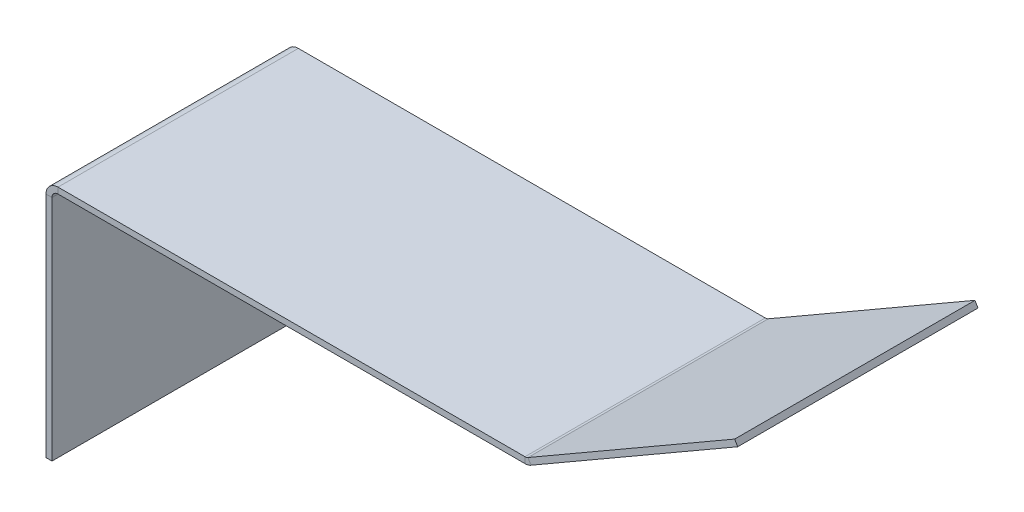
ISO-10303-21;
HEADER;
FILE_DESCRIPTION(('STEP AP214'),'2;1');
FILE_NAME('part.step','',(''),(''),'','','');
FILE_SCHEMA(('AUTOMOTIVE_DESIGN { 1 0 10303 214 1 1 1 1 }'));
ENDSEC;
DATA;
#1=APPLICATION_CONTEXT('core data for automotive mechanical design processes');
#2=APPLICATION_PROTOCOL_DEFINITION('international standard','automotive_design',2000,#1);
#3=PRODUCT_CONTEXT('',#1,'mechanical');
#4=PRODUCT('Part','Part','',(#3));
#5=PRODUCT_RELATED_PRODUCT_CATEGORY('part','',(#4));
#6=PRODUCT_DEFINITION_FORMATION('','',#4);
#7=PRODUCT_DEFINITION_CONTEXT('part definition',#1,'design');
#8=PRODUCT_DEFINITION('design','',#6,#7);
#9=PRODUCT_DEFINITION_SHAPE('','',#8);
#10=(LENGTH_UNIT() NAMED_UNIT(*) SI_UNIT(.MILLI.,.METRE.));
#11=(NAMED_UNIT(*) PLANE_ANGLE_UNIT() SI_UNIT($,.RADIAN.));
#12=(NAMED_UNIT(*) SI_UNIT($,.STERADIAN.) SOLID_ANGLE_UNIT());
#13=UNCERTAINTY_MEASURE_WITH_UNIT(LENGTH_MEASURE(1.E-05),#10,'distance_accuracy_value','');
#14=(GEOMETRIC_REPRESENTATION_CONTEXT(3) GLOBAL_UNCERTAINTY_ASSIGNED_CONTEXT((#13)) GLOBAL_UNIT_ASSIGNED_CONTEXT((#10,
#11,#12)) REPRESENTATION_CONTEXT('',''));
#15=CARTESIAN_POINT('',(0.,0.,0.));
#16=DIRECTION('',(0.,0.,1.));
#17=DIRECTION('',(1.,0.,0.));
#18=AXIS2_PLACEMENT_3D('',#15,#16,#17);
#19=CARTESIAN_POINT('',(6.35,127.,127.));
#20=DIRECTION('',(0.,0.,1.));
#21=DIRECTION('',(1.,0.,0.));
#22=AXIS2_PLACEMENT_3D('',#19,#20,#21);
#23=PLANE('',#22);
#24=DIRECTION('',(0.,-1.,0.));
#25=VECTOR('',#24,1.);
#26=CARTESIAN_POINT('',(6.35,127.,127.));
#27=LINE('',#26,#25);
#28=CARTESIAN_POINT('',(6.35,127.,127.));
#29=VERTEX_POINT('',#28);
#30=CARTESIAN_POINT('',(6.35,123.825,127.));
#31=VERTEX_POINT('',#30);
#32=EDGE_CURVE('E11',#29,#31,#27,.T.);
#33=ORIENTED_EDGE('',*,*,#32,.F.);
#34=CARTESIAN_POINT('',(6.35,120.65,127.));
#35=DIRECTION('',(0.,0.,1.));
#36=DIRECTION('',(1.,0.,0.));
#37=AXIS2_PLACEMENT_3D('',#34,#35,#36);
#38=CIRCLE('',#37,6.35);
#39=CARTESIAN_POINT('',(0.,120.65,127.));
#40=VERTEX_POINT('',#39);
#41=EDGE_CURVE('E290',#40,#29,#38,.F.);
#42=ORIENTED_EDGE('',*,*,#41,.F.);
#43=DIRECTION('',(-1.,0.,0.));
#44=VECTOR('',#43,1.);
#45=CARTESIAN_POINT('',(3.175,120.65,127.));
#46=LINE('',#45,#44);
#47=CARTESIAN_POINT('',(3.175,120.65,127.));
#48=VERTEX_POINT('',#47);
#49=EDGE_CURVE('E54',#48,#40,#46,.T.);
#50=ORIENTED_EDGE('',*,*,#49,.F.);
#51=CARTESIAN_POINT('',(6.35,120.65,127.));
#52=DIRECTION('',(0.,0.,1.));
#53=DIRECTION('',(1.,0.,0.));
#54=AXIS2_PLACEMENT_3D('',#51,#52,#53);
#55=CIRCLE('',#54,3.175);
#56=EDGE_CURVE('E155',#48,#31,#55,.F.);
#57=ORIENTED_EDGE('',*,*,#56,.T.);
#58=EDGE_LOOP('',(#33,#42,#50,#57));
#59=FACE_BOUND('',#58,.T.);
#60=ADVANCED_FACE('F45',(#59),#23,.T.);
#61=CARTESIAN_POINT('',(3.175,120.65,127.));
#62=DIRECTION('',(0.,0.,1.));
#63=DIRECTION('',(1.,0.,0.));
#64=AXIS2_PLACEMENT_3D('',#61,#62,#63);
#65=PLANE('',#64);
#66=DIRECTION('',(1.,0.,0.));
#67=VECTOR('',#66,1.);
#68=CARTESIAN_POINT('',(0.,127.,127.));
#69=LINE('',#68,#67);
#70=CARTESIAN_POINT('',(253.149261314031,127.,127.));
#71=VERTEX_POINT('',#70);
#72=EDGE_CURVE('E149',#29,#71,#69,.T.);
#73=ORIENTED_EDGE('',*,*,#72,.F.);
#74=ORIENTED_EDGE('',*,*,#32,.T.);
#75=DIRECTION('',(1.,0.,0.));
#76=VECTOR('',#75,1.);
#77=CARTESIAN_POINT('',(0.,123.825,127.));
#78=LINE('',#77,#76);
#79=CARTESIAN_POINT('',(253.149261314031,123.825,127.));
#80=VERTEX_POINT('',#79);
#81=EDGE_CURVE('E146',#31,#80,#78,.T.);
#82=ORIENTED_EDGE('',*,*,#81,.T.);
#83=DIRECTION('',(0.,1.,0.));
#84=VECTOR('',#83,1.);
#85=CARTESIAN_POINT('',(253.149261314031,123.825,127.));
#86=LINE('',#85,#84);
#87=EDGE_CURVE('E266',#80,#71,#86,.T.);
#88=ORIENTED_EDGE('',*,*,#87,.T.);
#89=EDGE_LOOP('',(#73,#74,#82,#88));
#90=FACE_BOUND('',#89,.T.);
#91=ADVANCED_FACE('F144',(#90),#65,.T.);
#92=CARTESIAN_POINT('',(0.,120.65,0.));
#93=DIRECTION('',(0.,0.,-1.));
#94=DIRECTION('',(-1.,0.,0.));
#95=AXIS2_PLACEMENT_3D('',#92,#93,#94);
#96=PLANE('',#95);
#97=DIRECTION('',(1.,0.,0.));
#98=VECTOR('',#97,1.);
#99=CARTESIAN_POINT('',(0.,120.65,0.));
#100=LINE('',#99,#98);
#101=CARTESIAN_POINT('',(0.,120.65,0.));
#102=VERTEX_POINT('',#101);
#103=CARTESIAN_POINT('',(3.175,120.65,0.));
#104=VERTEX_POINT('',#103);
#105=EDGE_CURVE('E274',#102,#104,#100,.T.);
#106=ORIENTED_EDGE('',*,*,#105,.F.);
#107=CARTESIAN_POINT('',(6.35,120.65,0.));
#108=DIRECTION('',(0.,0.,1.));
#109=DIRECTION('',(1.,0.,0.));
#110=AXIS2_PLACEMENT_3D('',#107,#108,#109);
#111=CIRCLE('',#110,6.35);
#112=CARTESIAN_POINT('',(6.35,127.,0.));
#113=VERTEX_POINT('',#112);
#114=EDGE_CURVE('E203',#102,#113,#111,.F.);
#115=ORIENTED_EDGE('',*,*,#114,.T.);
#116=DIRECTION('',(0.,1.,0.));
#117=VECTOR('',#116,1.);
#118=CARTESIAN_POINT('',(6.35,123.825,0.));
#119=LINE('',#118,#117);
#120=CARTESIAN_POINT('',(6.35,123.825,0.));
#121=VERTEX_POINT('',#120);
#122=EDGE_CURVE('E271',#121,#113,#119,.T.);
#123=ORIENTED_EDGE('',*,*,#122,.F.);
#124=CARTESIAN_POINT('',(6.35,120.65,0.));
#125=DIRECTION('',(0.,0.,1.));
#126=DIRECTION('',(1.,0.,0.));
#127=AXIS2_PLACEMENT_3D('',#124,#125,#126);
#128=CIRCLE('',#127,3.175);
#129=EDGE_CURVE('E168',#104,#121,#128,.F.);
#130=ORIENTED_EDGE('',*,*,#129,.F.);
#131=EDGE_LOOP('',(#106,#115,#123,#130));
#132=FACE_BOUND('',#131,.T.);
#133=ADVANCED_FACE('F337',(#132),#96,.T.);
#134=CARTESIAN_POINT('',(6.35,123.825,0.));
#135=DIRECTION('',(0.,0.,-1.));
#136=DIRECTION('',(-1.,0.,0.));
#137=AXIS2_PLACEMENT_3D('',#134,#135,#136);
#138=PLANE('',#137);
#139=DIRECTION('',(0.,1.,0.));
#140=VECTOR('',#139,1.);
#141=CARTESIAN_POINT('',(0.,0.,0.));
#142=LINE('',#141,#140);
#143=CARTESIAN_POINT('',(0.,0.,0.));
#144=VERTEX_POINT('',#143);
#145=EDGE_CURVE('E207',#144,#102,#142,.T.);
#146=ORIENTED_EDGE('',*,*,#145,.T.);
#147=ORIENTED_EDGE('',*,*,#105,.T.);
#148=DIRECTION('',(0.,1.,0.));
#149=VECTOR('',#148,1.);
#150=CARTESIAN_POINT('',(3.175,0.,0.));
#151=LINE('',#150,#149);
#152=CARTESIAN_POINT('',(3.175,0.,0.));
#153=VERTEX_POINT('',#152);
#154=EDGE_CURVE('E215',#153,#104,#151,.T.);
#155=ORIENTED_EDGE('',*,*,#154,.F.);
#156=DIRECTION('',(-1.,0.,0.));
#157=VECTOR('',#156,1.);
#158=CARTESIAN_POINT('',(3.175,0.,0.));
#159=LINE('',#158,#157);
#160=EDGE_CURVE('E211',#153,#144,#159,.T.);
#161=ORIENTED_EDGE('',*,*,#160,.T.);
#162=EDGE_LOOP('',(#146,#147,#155,#161));
#163=FACE_BOUND('',#162,.T.);
#164=ADVANCED_FACE('F340',(#163),#138,.T.);
#165=CARTESIAN_POINT('',(254.736761314031,127.425369342984,127.));
#166=DIRECTION('',(0.,0.,1.));
#167=DIRECTION('',(1.,0.,0.));
#168=AXIS2_PLACEMENT_3D('',#165,#166,#167);
#169=PLANE('',#168);
#170=DIRECTION('',(0.500000000000006,-0.866025403784435,0.));
#171=VECTOR('',#170,1.);
#172=CARTESIAN_POINT('',(254.736761314031,127.425369342984,127.));
#173=LINE('',#172,#171);
#174=CARTESIAN_POINT('',(254.736761314031,127.425369342984,127.));
#175=VERTEX_POINT('',#174);
#176=CARTESIAN_POINT('',(256.324261314031,124.675738685969,127.));
#177=VERTEX_POINT('',#176);
#178=EDGE_CURVE('E62',#175,#177,#173,.T.);
#179=ORIENTED_EDGE('',*,*,#178,.F.);
#180=CARTESIAN_POINT('',(253.149261314031,130.175,127.));
#181=DIRECTION('',(0.,0.,-1.));
#182=DIRECTION('',(-1.,0.,0.));
#183=AXIS2_PLACEMENT_3D('',#180,#181,#182);
#184=CIRCLE('',#183,3.175);
#185=EDGE_CURVE('E305',#71,#175,#184,.F.);
#186=ORIENTED_EDGE('',*,*,#185,.F.);
#187=ORIENTED_EDGE('',*,*,#87,.F.);
#188=CARTESIAN_POINT('',(253.149261314031,130.175,127.));
#189=DIRECTION('',(0.,0.,1.));
#190=DIRECTION('',(1.,0.,0.));
#191=AXIS2_PLACEMENT_3D('',#188,#189,#190);
#192=CIRCLE('',#191,6.35);
#193=EDGE_CURVE('E178',#80,#177,#192,.T.);
#194=ORIENTED_EDGE('',*,*,#193,.T.);
#195=EDGE_LOOP('',(#179,#186,#187,#194));
#196=FACE_BOUND('',#195,.T.);
#197=ADVANCED_FACE('F332',(#196),#169,.T.);
#198=CARTESIAN_POINT('',(253.149261314031,123.825,127.));
#199=DIRECTION('',(0.,0.,1.));
#200=DIRECTION('',(1.,0.,0.));
#201=AXIS2_PLACEMENT_3D('',#198,#199,#200);
#202=PLANE('',#201);
#203=DIRECTION('',(0.866025403784438,0.500000000000001,0.));
#204=VECTOR('',#203,1.);
#205=CARTESIAN_POINT('',(254.,127.,127.));
#206=LINE('',#205,#204);
#207=CARTESIAN_POINT('',(363.985226280624,190.5,127.));
#208=VERTEX_POINT('',#207);
#209=EDGE_CURVE('E309',#175,#208,#206,.T.);
#210=ORIENTED_EDGE('',*,*,#209,.F.);
#211=ORIENTED_EDGE('',*,*,#178,.T.);
#212=DIRECTION('',(0.866025403784438,0.500000000000002,0.));
#213=VECTOR('',#212,1.);
#214=CARTESIAN_POINT('',(255.5875,124.250369342984,127.));
#215=LINE('',#214,#213);
#216=CARTESIAN_POINT('',(365.572726280624,187.750369342985,127.));
#217=VERTEX_POINT('',#216);
#218=EDGE_CURVE('E116',#177,#217,#215,.T.);
#219=ORIENTED_EDGE('',*,*,#218,.T.);
#220=DIRECTION('',(0.500000000000023,-0.866025403784425,0.));
#221=VECTOR('',#220,1.);
#222=CARTESIAN_POINT('',(363.985226280624,190.5,127.));
#223=LINE('',#222,#221);
#224=EDGE_CURVE('E313',#208,#217,#223,.T.);
#225=ORIENTED_EDGE('',*,*,#224,.F.);
#226=EDGE_LOOP('',(#210,#211,#219,#225));
#227=FACE_BOUND('',#226,.T.);
#228=ADVANCED_FACE('F321',(#227),#202,.T.);
#229=CARTESIAN_POINT('',(253.149261314031,127.,0.));
#230=DIRECTION('',(0.,0.,-1.));
#231=DIRECTION('',(-1.,0.,0.));
#232=AXIS2_PLACEMENT_3D('',#229,#230,#231);
#233=PLANE('',#232);
#234=DIRECTION('',(0.,-1.,0.));
#235=VECTOR('',#234,1.);
#236=CARTESIAN_POINT('',(253.149261314031,127.,0.));
#237=LINE('',#236,#235);
#238=CARTESIAN_POINT('',(253.149261314031,127.,0.));
#239=VERTEX_POINT('',#238);
#240=CARTESIAN_POINT('',(253.149261314031,123.825,0.));
#241=VERTEX_POINT('',#240);
#242=EDGE_CURVE('E103',#239,#241,#237,.T.);
#243=ORIENTED_EDGE('',*,*,#242,.F.);
#244=CARTESIAN_POINT('',(253.149261314031,130.175,0.));
#245=DIRECTION('',(0.,0.,-1.));
#246=DIRECTION('',(-1.,0.,0.));
#247=AXIS2_PLACEMENT_3D('',#244,#245,#246);
#248=CIRCLE('',#247,3.175);
#249=CARTESIAN_POINT('',(254.736761314031,127.425369342984,0.));
#250=VERTEX_POINT('',#249);
#251=EDGE_CURVE('E197',#239,#250,#248,.F.);
#252=ORIENTED_EDGE('',*,*,#251,.T.);
#253=DIRECTION('',(-0.500000000000006,0.866025403784435,0.));
#254=VECTOR('',#253,1.);
#255=CARTESIAN_POINT('',(256.324261314031,124.675738685969,0.));
#256=LINE('',#255,#254);
#257=CARTESIAN_POINT('',(256.324261314031,124.675738685969,0.));
#258=VERTEX_POINT('',#257);
#259=EDGE_CURVE('E110',#258,#250,#256,.T.);
#260=ORIENTED_EDGE('',*,*,#259,.F.);
#261=CARTESIAN_POINT('',(253.149261314031,130.175,0.));
#262=DIRECTION('',(0.,0.,1.));
#263=DIRECTION('',(1.,0.,0.));
#264=AXIS2_PLACEMENT_3D('',#261,#262,#263);
#265=CIRCLE('',#264,6.35);
#266=EDGE_CURVE('E224',#241,#258,#265,.T.);
#267=ORIENTED_EDGE('',*,*,#266,.F.);
#268=EDGE_LOOP('',(#243,#252,#260,#267));
#269=FACE_BOUND('',#268,.T.);
#270=ADVANCED_FACE('F369',(#269),#233,.T.);
#271=CARTESIAN_POINT('',(256.324261314031,124.675738685969,0.));
#272=DIRECTION('',(0.,0.,-1.));
#273=DIRECTION('',(-1.,0.,0.));
#274=AXIS2_PLACEMENT_3D('',#271,#272,#273);
#275=PLANE('',#274);
#276=DIRECTION('',(1.,0.,0.));
#277=VECTOR('',#276,1.);
#278=CARTESIAN_POINT('',(0.,127.,0.));
#279=LINE('',#278,#277);
#280=EDGE_CURVE('E200',#113,#239,#279,.T.);
#281=ORIENTED_EDGE('',*,*,#280,.T.);
#282=ORIENTED_EDGE('',*,*,#242,.T.);
#283=DIRECTION('',(1.,0.,0.));
#284=VECTOR('',#283,1.);
#285=CARTESIAN_POINT('',(0.,123.825,0.));
#286=LINE('',#285,#284);
#287=EDGE_CURVE('E221',#121,#241,#286,.T.);
#288=ORIENTED_EDGE('',*,*,#287,.F.);
#289=ORIENTED_EDGE('',*,*,#122,.T.);
#290=EDGE_LOOP('',(#281,#282,#288,#289));
#291=FACE_BOUND('',#290,.T.);
#292=ADVANCED_FACE('F372',(#291),#275,.T.);
#293=CARTESIAN_POINT('',(255.5875,124.250369342984,127.));
#294=DIRECTION('',(-0.500000000000001,0.866025403784438,0.));
#295=DIRECTION('',(-0.866025403784438,-0.500000000000002,0.));
#296=AXIS2_PLACEMENT_3D('',#293,#294,#295);
#297=PLANE('',#296);
#298=DIRECTION('',(0.866025403784438,0.500000000000002,0.));
#299=VECTOR('',#298,1.);
#300=CARTESIAN_POINT('',(255.5875,124.250369342984,0.));
#301=LINE('',#300,#299);
#302=CARTESIAN_POINT('',(365.572726280624,187.750369342985,0.));
#303=VERTEX_POINT('',#302);
#304=EDGE_CURVE('E185',#258,#303,#301,.T.);
#305=ORIENTED_EDGE('',*,*,#304,.T.);
#306=DIRECTION('',(0.,0.,-1.));
#307=VECTOR('',#306,1.);
#308=CARTESIAN_POINT('',(365.572726280624,187.750369342985,127.));
#309=LINE('',#308,#307);
#310=EDGE_CURVE('E259',#217,#303,#309,.T.);
#311=ORIENTED_EDGE('',*,*,#310,.F.);
#312=ORIENTED_EDGE('',*,*,#218,.F.);
#313=DIRECTION('',(0.,0.,-1.));
#314=VECTOR('',#313,1.);
#315=CARTESIAN_POINT('',(256.324261314031,124.675738685969,127.));
#316=LINE('',#315,#314);
#317=EDGE_CURVE('E181',#177,#258,#316,.T.);
#318=ORIENTED_EDGE('',*,*,#317,.T.);
#319=EDGE_LOOP('',(#305,#311,#312,#318));
#320=FACE_BOUND('',#319,.T.);
#321=ADVANCED_FACE('F375',(#320),#297,.F.);
#322=CARTESIAN_POINT('',(363.985226280624,190.5,127.));
#323=DIRECTION('',(0.866025403784426,0.500000000000023,0.));
#324=DIRECTION('',(-0.500000000000023,0.866025403784426,0.));
#325=AXIS2_PLACEMENT_3D('',#322,#323,#324);
#326=PLANE('',#325);
#327=DIRECTION('',(0.500000000000023,-0.866025403784425,0.));
#328=VECTOR('',#327,1.);
#329=CARTESIAN_POINT('',(363.985226280624,190.5,0.));
#330=LINE('',#329,#328);
#331=CARTESIAN_POINT('',(363.985226280624,190.5,0.));
#332=VERTEX_POINT('',#331);
#333=EDGE_CURVE('E189',#332,#303,#330,.T.);
#334=ORIENTED_EDGE('',*,*,#333,.F.);
#335=DIRECTION('',(0.,0.,-1.));
#336=VECTOR('',#335,1.);
#337=CARTESIAN_POINT('',(363.985226280624,190.5,127.));
#338=LINE('',#337,#336);
#339=EDGE_CURVE('E256',#208,#332,#338,.T.);
#340=ORIENTED_EDGE('',*,*,#339,.F.);
#341=ORIENTED_EDGE('',*,*,#224,.T.);
#342=ORIENTED_EDGE('',*,*,#310,.T.);
#343=EDGE_LOOP('',(#334,#340,#341,#342));
#344=FACE_BOUND('',#343,.T.);
#345=ADVANCED_FACE('F320',(#344),#326,.T.);
#346=CARTESIAN_POINT('',(254.,127.,127.));
#347=DIRECTION('',(-0.500000000000001,0.866025403784438,0.));
#348=DIRECTION('',(-0.866025403784438,-0.500000000000001,0.));
#349=AXIS2_PLACEMENT_3D('',#346,#347,#348);
#350=PLANE('',#349);
#351=DIRECTION('',(0.866025403784438,0.500000000000001,0.));
#352=VECTOR('',#351,1.);
#353=CARTESIAN_POINT('',(254.,127.,0.));
#354=LINE('',#353,#352);
#355=EDGE_CURVE('E193',#250,#332,#354,.T.);
#356=ORIENTED_EDGE('',*,*,#355,.F.);
#357=DIRECTION('',(0.,0.,-1.));
#358=VECTOR('',#357,1.);
#359=CARTESIAN_POINT('',(254.736761314031,127.425369342984,127.));
#360=LINE('',#359,#358);
#361=EDGE_CURVE('E252',#175,#250,#360,.T.);
#362=ORIENTED_EDGE('',*,*,#361,.F.);
#363=ORIENTED_EDGE('',*,*,#209,.T.);
#364=ORIENTED_EDGE('',*,*,#339,.T.);
#365=EDGE_LOOP('',(#356,#362,#363,#364));
#366=FACE_BOUND('',#365,.T.);
#367=ADVANCED_FACE('F325',(#366),#350,.T.);
#368=CARTESIAN_POINT('',(253.149261314031,130.175,127.));
#369=DIRECTION('',(0.,0.,-1.));
#370=DIRECTION('',(-1.,0.,0.));
#371=AXIS2_PLACEMENT_3D('',#368,#369,#370);
#372=CYLINDRICAL_SURFACE('',#371,3.175);
#373=ORIENTED_EDGE('',*,*,#251,.F.);
#374=DIRECTION('',(0.,0.,-1.));
#375=VECTOR('',#374,1.);
#376=CARTESIAN_POINT('',(253.149261314031,127.,127.));
#377=LINE('',#376,#375);
#378=EDGE_CURVE('E248',#71,#239,#377,.T.);
#379=ORIENTED_EDGE('',*,*,#378,.F.);
#380=ORIENTED_EDGE('',*,*,#185,.T.);
#381=ORIENTED_EDGE('',*,*,#361,.T.);
#382=EDGE_LOOP('',(#373,#379,#380,#381));
#383=FACE_BOUND('',#382,.T.);
#384=ADVANCED_FACE('F328',(#383),#372,.F.);
#385=CARTESIAN_POINT('',(0.,127.,127.));
#386=DIRECTION('',(0.,1.,0.));
#387=DIRECTION('',(0.,0.,1.));
#388=AXIS2_PLACEMENT_3D('',#385,#386,#387);
#389=PLANE('',#388);
#390=ORIENTED_EDGE('',*,*,#280,.F.);
#391=DIRECTION('',(0.,0.,-1.));
#392=VECTOR('',#391,1.);
#393=CARTESIAN_POINT('',(6.35,127.,127.));
#394=LINE('',#393,#392);
#395=EDGE_CURVE('E244',#29,#113,#394,.T.);
#396=ORIENTED_EDGE('',*,*,#395,.F.);
#397=ORIENTED_EDGE('',*,*,#72,.T.);
#398=ORIENTED_EDGE('',*,*,#378,.T.);
#399=EDGE_LOOP('',(#390,#396,#397,#398));
#400=FACE_BOUND('',#399,.T.);
#401=ADVANCED_FACE('F335',(#400),#389,.T.);
#402=CARTESIAN_POINT('',(6.35,120.65,127.));
#403=DIRECTION('',(0.,0.,-1.));
#404=DIRECTION('',(-1.,0.,0.));
#405=AXIS2_PLACEMENT_3D('',#402,#403,#404);
#406=CYLINDRICAL_SURFACE('',#405,6.35);
#407=ORIENTED_EDGE('',*,*,#114,.F.);
#408=DIRECTION('',(0.,0.,-1.));
#409=VECTOR('',#408,1.);
#410=CARTESIAN_POINT('',(0.,120.65,127.));
#411=LINE('',#410,#409);
#412=EDGE_CURVE('E240',#40,#102,#411,.T.);
#413=ORIENTED_EDGE('',*,*,#412,.F.);
#414=ORIENTED_EDGE('',*,*,#41,.T.);
#415=ORIENTED_EDGE('',*,*,#395,.T.);
#416=EDGE_LOOP('',(#407,#413,#414,#415));
#417=FACE_BOUND('',#416,.T.);
#418=ADVANCED_FACE('F289',(#417),#406,.T.);
#419=CARTESIAN_POINT('',(0.,0.,127.));
#420=DIRECTION('',(-1.,0.,0.));
#421=DIRECTION('',(0.,0.,1.));
#422=AXIS2_PLACEMENT_3D('',#419,#420,#421);
#423=PLANE('',#422);
#424=ORIENTED_EDGE('',*,*,#145,.F.);
#425=DIRECTION('',(0.,0.,-1.));
#426=VECTOR('',#425,1.);
#427=CARTESIAN_POINT('',(0.,0.,127.));
#428=LINE('',#427,#426);
#429=CARTESIAN_POINT('',(0.,0.,127.));
#430=VERTEX_POINT('',#429);
#431=EDGE_CURVE('E237',#430,#144,#428,.T.);
#432=ORIENTED_EDGE('',*,*,#431,.F.);
#433=DIRECTION('',(0.,1.,0.));
#434=VECTOR('',#433,1.);
#435=CARTESIAN_POINT('',(0.,0.,127.));
#436=LINE('',#435,#434);
#437=EDGE_CURVE('E283',#430,#40,#436,.T.);
#438=ORIENTED_EDGE('',*,*,#437,.T.);
#439=ORIENTED_EDGE('',*,*,#412,.T.);
#440=EDGE_LOOP('',(#424,#432,#438,#439));
#441=FACE_BOUND('',#440,.T.);
#442=ADVANCED_FACE('F295',(#441),#423,.T.);
#443=CARTESIAN_POINT('',(3.175,0.,127.));
#444=DIRECTION('',(0.,-1.,0.));
#445=DIRECTION('',(0.,0.,-1.));
#446=AXIS2_PLACEMENT_3D('',#443,#444,#445);
#447=PLANE('',#446);
#448=ORIENTED_EDGE('',*,*,#160,.F.);
#449=DIRECTION('',(0.,0.,-1.));
#450=VECTOR('',#449,1.);
#451=CARTESIAN_POINT('',(3.175,0.,127.));
#452=LINE('',#451,#450);
#453=CARTESIAN_POINT('',(3.175,0.,127.));
#454=VERTEX_POINT('',#453);
#455=EDGE_CURVE('E234',#454,#153,#452,.T.);
#456=ORIENTED_EDGE('',*,*,#455,.F.);
#457=DIRECTION('',(-1.,0.,0.));
#458=VECTOR('',#457,1.);
#459=CARTESIAN_POINT('',(3.175,0.,127.));
#460=LINE('',#459,#458);
#461=EDGE_CURVE('E297',#454,#430,#460,.T.);
#462=ORIENTED_EDGE('',*,*,#461,.T.);
#463=ORIENTED_EDGE('',*,*,#431,.T.);
#464=EDGE_LOOP('',(#448,#456,#462,#463));
#465=FACE_BOUND('',#464,.T.);
#466=ADVANCED_FACE('F345',(#465),#447,.T.);
#467=CARTESIAN_POINT('',(3.175,0.,127.));
#468=DIRECTION('',(-1.,0.,0.));
#469=DIRECTION('',(0.,0.,1.));
#470=AXIS2_PLACEMENT_3D('',#467,#468,#469);
#471=PLANE('',#470);
#472=ORIENTED_EDGE('',*,*,#154,.T.);
#473=DIRECTION('',(0.,0.,-1.));
#474=VECTOR('',#473,1.);
#475=CARTESIAN_POINT('',(3.175,120.65,127.));
#476=LINE('',#475,#474);
#477=EDGE_CURVE('E171',#48,#104,#476,.T.);
#478=ORIENTED_EDGE('',*,*,#477,.F.);
#479=DIRECTION('',(0.,1.,0.));
#480=VECTOR('',#479,1.);
#481=CARTESIAN_POINT('',(3.175,0.,127.));
#482=LINE('',#481,#480);
#483=EDGE_CURVE('E161',#454,#48,#482,.T.);
#484=ORIENTED_EDGE('',*,*,#483,.F.);
#485=ORIENTED_EDGE('',*,*,#455,.T.);
#486=EDGE_LOOP('',(#472,#478,#484,#485));
#487=FACE_BOUND('',#486,.T.);
#488=ADVANCED_FACE('F343',(#487),#471,.F.);
#489=CARTESIAN_POINT('',(6.35,120.65,127.));
#490=DIRECTION('',(0.,0.,-1.));
#491=DIRECTION('',(-1.,0.,0.));
#492=AXIS2_PLACEMENT_3D('',#489,#490,#491);
#493=CYLINDRICAL_SURFACE('',#492,3.175);
#494=ORIENTED_EDGE('',*,*,#129,.T.);
#495=DIRECTION('',(0.,0.,-1.));
#496=VECTOR('',#495,1.);
#497=CARTESIAN_POINT('',(6.35,123.825,127.));
#498=LINE('',#497,#496);
#499=EDGE_CURVE('E165',#31,#121,#498,.T.);
#500=ORIENTED_EDGE('',*,*,#499,.F.);
#501=ORIENTED_EDGE('',*,*,#56,.F.);
#502=ORIENTED_EDGE('',*,*,#477,.T.);
#503=EDGE_LOOP('',(#494,#500,#501,#502));
#504=FACE_BOUND('',#503,.T.);
#505=ADVANCED_FACE('F166',(#504),#493,.F.);
#506=CARTESIAN_POINT('',(0.,123.825,127.));
#507=DIRECTION('',(0.,1.,0.));
#508=DIRECTION('',(0.,0.,1.));
#509=AXIS2_PLACEMENT_3D('',#506,#507,#508);
#510=PLANE('',#509);
#511=ORIENTED_EDGE('',*,*,#287,.T.);
#512=DIRECTION('',(0.,0.,-1.));
#513=VECTOR('',#512,1.);
#514=CARTESIAN_POINT('',(253.149261314031,123.825,127.));
#515=LINE('',#514,#513);
#516=EDGE_CURVE('E172',#80,#241,#515,.T.);
#517=ORIENTED_EDGE('',*,*,#516,.F.);
#518=ORIENTED_EDGE('',*,*,#81,.F.);
#519=ORIENTED_EDGE('',*,*,#499,.T.);
#520=EDGE_LOOP('',(#511,#517,#518,#519));
#521=FACE_BOUND('',#520,.T.);
#522=ADVANCED_FACE('F174',(#521),#510,.F.);
#523=CARTESIAN_POINT('',(253.149261314031,130.175,127.));
#524=DIRECTION('',(0.,0.,-1.));
#525=DIRECTION('',(-1.,0.,0.));
#526=AXIS2_PLACEMENT_3D('',#523,#524,#525);
#527=CYLINDRICAL_SURFACE('',#526,6.35);
#528=ORIENTED_EDGE('',*,*,#266,.T.);
#529=ORIENTED_EDGE('',*,*,#317,.F.);
#530=ORIENTED_EDGE('',*,*,#193,.F.);
#531=ORIENTED_EDGE('',*,*,#516,.T.);
#532=EDGE_LOOP('',(#528,#529,#530,#531));
#533=FACE_BOUND('',#532,.T.);
#534=ADVANCED_FACE('F427',(#533),#527,.T.);
#535=CARTESIAN_POINT('',(253.149261314031,130.175,127.));
#536=DIRECTION('',(0.,0.,-1.));
#537=DIRECTION('',(-1.,0.,0.));
#538=AXIS2_PLACEMENT_3D('',#535,#536,#537);
#539=PLANE('',#538);
#540=ORIENTED_EDGE('',*,*,#483,.T.);
#541=ORIENTED_EDGE('',*,*,#49,.T.);
#542=ORIENTED_EDGE('',*,*,#437,.F.);
#543=ORIENTED_EDGE('',*,*,#461,.F.);
#544=EDGE_LOOP('',(#540,#541,#542,#543));
#545=FACE_BOUND('',#544,.T.);
#546=ADVANCED_FACE('F280',(#545),#539,.F.);
#547=CARTESIAN_POINT('',(253.149261314031,130.175,0.));
#548=DIRECTION('',(0.,0.,-1.));
#549=DIRECTION('',(-1.,0.,0.));
#550=AXIS2_PLACEMENT_3D('',#547,#548,#549);
#551=PLANE('',#550);
#552=ORIENTED_EDGE('',*,*,#304,.F.);
#553=ORIENTED_EDGE('',*,*,#259,.T.);
#554=ORIENTED_EDGE('',*,*,#355,.T.);
#555=ORIENTED_EDGE('',*,*,#333,.T.);
#556=EDGE_LOOP('',(#552,#553,#554,#555));
#557=FACE_BOUND('',#556,.T.);
#558=ADVANCED_FACE('F447',(#557),#551,.T.);
#559=CLOSED_SHELL('',(#60,#91,#133,#164,#197,#228,#270,#292,#321,#345,#367,#384,#401,#418,#442,
#466,#488,#505,#522,#534,#546,#558));
#560=MANIFOLD_SOLID_BREP('B2',#559);
#561=ADVANCED_BREP_SHAPE_REPRESENTATION('',(#18,#560),#14);
#562=SHAPE_DEFINITION_REPRESENTATION(#9,#561);
ENDSEC;
END-ISO-10303-21;
